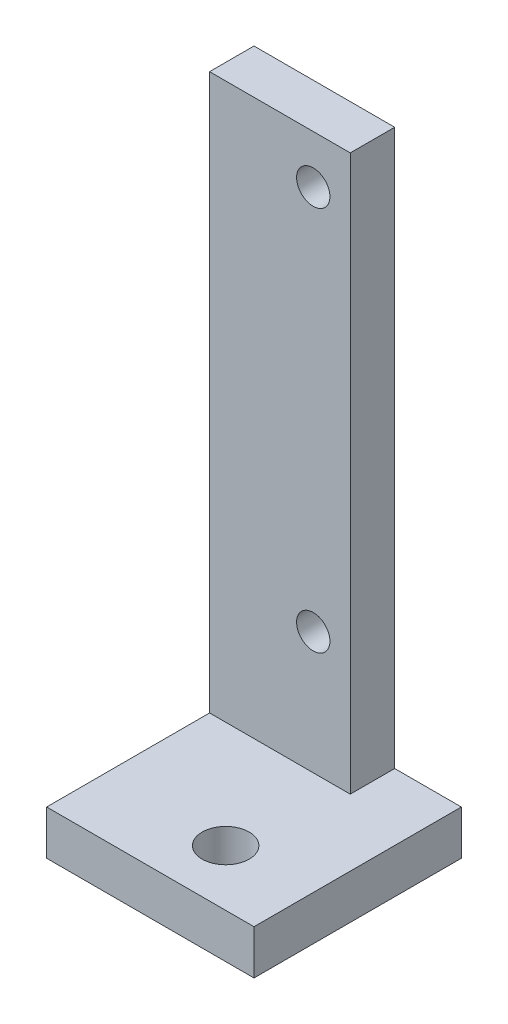
ISO-10303-21;
HEADER;
FILE_DESCRIPTION(('STEP AP214'),'2;1');
FILE_NAME('part.step','',(''),(''),'','','');
FILE_SCHEMA(('AUTOMOTIVE_DESIGN { 1 0 10303 214 1 1 1 1 }'));
ENDSEC;
DATA;
#1=APPLICATION_CONTEXT('core data for automotive mechanical design processes');
#2=APPLICATION_PROTOCOL_DEFINITION('international standard','automotive_design',2000,#1);
#3=PRODUCT_CONTEXT('',#1,'mechanical');
#4=PRODUCT('Part','Part','',(#3));
#5=PRODUCT_RELATED_PRODUCT_CATEGORY('part','',(#4));
#6=PRODUCT_DEFINITION_FORMATION('','',#4);
#7=PRODUCT_DEFINITION_CONTEXT('part definition',#1,'design');
#8=PRODUCT_DEFINITION('design','',#6,#7);
#9=PRODUCT_DEFINITION_SHAPE('','',#8);
#10=(LENGTH_UNIT() NAMED_UNIT(*) SI_UNIT(.MILLI.,.METRE.));
#11=(NAMED_UNIT(*) PLANE_ANGLE_UNIT() SI_UNIT($,.RADIAN.));
#12=(NAMED_UNIT(*) SI_UNIT($,.STERADIAN.) SOLID_ANGLE_UNIT());
#13=UNCERTAINTY_MEASURE_WITH_UNIT(LENGTH_MEASURE(1.E-05),#10,'distance_accuracy_value','');
#14=(GEOMETRIC_REPRESENTATION_CONTEXT(3) GLOBAL_UNCERTAINTY_ASSIGNED_CONTEXT((#13)) GLOBAL_UNIT_ASSIGNED_CONTEXT((#10,
#11,#12)) REPRESENTATION_CONTEXT('',''));
#15=CARTESIAN_POINT('',(0.,0.,0.));
#16=DIRECTION('',(0.,0.,1.));
#17=DIRECTION('',(1.,0.,0.));
#18=AXIS2_PLACEMENT_3D('',#15,#16,#17);
#19=CARTESIAN_POINT('',(4.99999999999999,0.,6.));
#20=DIRECTION('',(1.,0.,0.));
#21=DIRECTION('',(0.,1.,0.));
#22=AXIS2_PLACEMENT_3D('',#19,#20,#21);
#23=PLANE('',#22);
#24=DIRECTION('',(0.,-1.,0.));
#25=VECTOR('',#24,1.);
#26=CARTESIAN_POINT('',(4.99999999999999,0.,0.));
#27=LINE('',#26,#25);
#28=CARTESIAN_POINT('',(4.99999999999999,32.5,0.));
#29=VERTEX_POINT('',#28);
#30=CARTESIAN_POINT('',(5.,-42.5,0.));
#31=VERTEX_POINT('',#30);
#32=EDGE_CURVE('E146',#29,#31,#27,.T.);
#33=ORIENTED_EDGE('',*,*,#32,.F.);
#34=DIRECTION('',(0.,0.,-1.));
#35=VECTOR('',#34,1.);
#36=CARTESIAN_POINT('',(4.99999999999999,32.5,6.));
#37=LINE('',#36,#35);
#38=CARTESIAN_POINT('',(4.99999999999999,32.5,6.));
#39=VERTEX_POINT('',#38);
#40=EDGE_CURVE('E11',#39,#29,#37,.T.);
#41=ORIENTED_EDGE('',*,*,#40,.F.);
#42=DIRECTION('',(0.,-1.,0.));
#43=VECTOR('',#42,1.);
#44=CARTESIAN_POINT('',(4.99999999999999,0.,6.));
#45=LINE('',#44,#43);
#46=CARTESIAN_POINT('',(5.,-42.5,6.));
#47=VERTEX_POINT('',#46);
#48=EDGE_CURVE('E149',#39,#47,#45,.T.);
#49=ORIENTED_EDGE('',*,*,#48,.T.);
#50=DIRECTION('',(0.,0.,-1.));
#51=VECTOR('',#50,1.);
#52=CARTESIAN_POINT('',(5.,-42.5,6.));
#53=LINE('',#52,#51);
#54=EDGE_CURVE('E56',#47,#31,#53,.T.);
#55=ORIENTED_EDGE('',*,*,#54,.T.);
#56=EDGE_LOOP('',(#33,#41,#49,#55));
#57=FACE_BOUND('',#56,.T.);
#58=ADVANCED_FACE('F47',(#57),#23,.T.);
#59=CARTESIAN_POINT('',(0.,32.5,6.));
#60=DIRECTION('',(0.,1.,0.));
#61=DIRECTION('',(0.,0.,1.));
#62=AXIS2_PLACEMENT_3D('',#59,#60,#61);
#63=PLANE('',#62);
#64=DIRECTION('',(1.,0.,0.));
#65=VECTOR('',#64,1.);
#66=CARTESIAN_POINT('',(0.,32.5,0.));
#67=LINE('',#66,#65);
#68=CARTESIAN_POINT('',(-14.,32.5,0.));
#69=VERTEX_POINT('',#68);
#70=EDGE_CURVE('E171',#69,#29,#67,.T.);
#71=ORIENTED_EDGE('',*,*,#70,.F.);
#72=DIRECTION('',(0.,0.,-1.));
#73=VECTOR('',#72,1.);
#74=CARTESIAN_POINT('',(-14.,32.5,0.));
#75=LINE('',#74,#73);
#76=CARTESIAN_POINT('',(-14.,32.5,6.));
#77=VERTEX_POINT('',#76);
#78=EDGE_CURVE('E131',#77,#69,#75,.T.);
#79=ORIENTED_EDGE('',*,*,#78,.F.);
#80=DIRECTION('',(1.,0.,0.));
#81=VECTOR('',#80,1.);
#82=CARTESIAN_POINT('',(0.,32.5,6.));
#83=LINE('',#82,#81);
#84=EDGE_CURVE('E153',#77,#39,#83,.T.);
#85=ORIENTED_EDGE('',*,*,#84,.T.);
#86=ORIENTED_EDGE('',*,*,#40,.T.);
#87=EDGE_LOOP('',(#71,#79,#85,#86));
#88=FACE_BOUND('',#87,.T.);
#89=ADVANCED_FACE('F187',(#88),#63,.T.);
#90=CARTESIAN_POINT('',(0.,26.,6.));
#91=DIRECTION('',(0.,0.,-1.));
#92=DIRECTION('',(-1.,0.,0.));
#93=AXIS2_PLACEMENT_3D('',#90,#91,#92);
#94=CYLINDRICAL_SURFACE('',#93,2.25);
#95=CARTESIAN_POINT('',(0.,26.,6.));
#96=DIRECTION('',(0.,0.,1.));
#97=DIRECTION('',(1.,0.,0.));
#98=AXIS2_PLACEMENT_3D('',#95,#96,#97);
#99=CIRCLE('',#98,2.25);
#100=CARTESIAN_POINT('',(2.25,26.,6.));
#101=VERTEX_POINT('',#100);
#102=EDGE_CURVE('E161',#101,#101,#99,.T.);
#103=ORIENTED_EDGE('',*,*,#102,.T.);
#104=EDGE_LOOP('',(#103));
#105=FACE_BOUND('',#104,.T.);
#106=CARTESIAN_POINT('',(0.,26.,0.));
#107=DIRECTION('',(0.,0.,1.));
#108=DIRECTION('',(1.,0.,0.));
#109=AXIS2_PLACEMENT_3D('',#106,#107,#108);
#110=CIRCLE('',#109,2.25);
#111=CARTESIAN_POINT('',(2.25,26.,0.));
#112=VERTEX_POINT('',#111);
#113=EDGE_CURVE('E175',#112,#112,#110,.T.);
#114=ORIENTED_EDGE('',*,*,#113,.F.);
#115=EDGE_LOOP('',(#114));
#116=FACE_BOUND('',#115,.T.);
#117=ADVANCED_FACE('F241',(#105,#116),#94,.F.);
#118=CARTESIAN_POINT('',(0.,-26.,6.));
#119=DIRECTION('',(0.,0.,-1.));
#120=DIRECTION('',(-1.,0.,0.));
#121=AXIS2_PLACEMENT_3D('',#118,#119,#120);
#122=CYLINDRICAL_SURFACE('',#121,2.25);
#123=CARTESIAN_POINT('',(0.,-26.,6.));
#124=DIRECTION('',(0.,0.,1.));
#125=DIRECTION('',(1.,0.,0.));
#126=AXIS2_PLACEMENT_3D('',#123,#124,#125);
#127=CIRCLE('',#126,2.25);
#128=CARTESIAN_POINT('',(2.25,-26.,6.));
#129=VERTEX_POINT('',#128);
#130=EDGE_CURVE('E165',#129,#129,#127,.F.);
#131=ORIENTED_EDGE('',*,*,#130,.F.);
#132=EDGE_LOOP('',(#131));
#133=FACE_BOUND('',#132,.T.);
#134=CARTESIAN_POINT('',(0.,-26.,0.));
#135=DIRECTION('',(0.,0.,1.));
#136=DIRECTION('',(1.,0.,0.));
#137=AXIS2_PLACEMENT_3D('',#134,#135,#136);
#138=CIRCLE('',#137,2.25);
#139=CARTESIAN_POINT('',(2.25,-26.,0.));
#140=VERTEX_POINT('',#139);
#141=EDGE_CURVE('E154',#140,#140,#138,.F.);
#142=ORIENTED_EDGE('',*,*,#141,.T.);
#143=EDGE_LOOP('',(#142));
#144=FACE_BOUND('',#143,.T.);
#145=ADVANCED_FACE('F246',(#133,#144),#122,.F.);
#146=CARTESIAN_POINT('',(0.,0.,6.));
#147=DIRECTION('',(0.,0.,1.));
#148=DIRECTION('',(1.,0.,0.));
#149=AXIS2_PLACEMENT_3D('',#146,#147,#148);
#150=PLANE('',#149);
#151=ORIENTED_EDGE('',*,*,#48,.F.);
#152=ORIENTED_EDGE('',*,*,#84,.F.);
#153=DIRECTION('',(0.,1.,0.));
#154=VECTOR('',#153,1.);
#155=CARTESIAN_POINT('',(-14.,32.4999999999999,6.));
#156=LINE('',#155,#154);
#157=CARTESIAN_POINT('',(-14.,-42.5,6.));
#158=VERTEX_POINT('',#157);
#159=EDGE_CURVE('E142',#158,#77,#156,.T.);
#160=ORIENTED_EDGE('',*,*,#159,.F.);
#161=DIRECTION('',(1.,0.,0.));
#162=VECTOR('',#161,1.);
#163=CARTESIAN_POINT('',(0.,-42.5,6.));
#164=LINE('',#163,#162);
#165=EDGE_CURVE('E158',#158,#47,#164,.T.);
#166=ORIENTED_EDGE('',*,*,#165,.T.);
#167=EDGE_LOOP('',(#151,#152,#160,#166));
#168=FACE_BOUND('',#167,.T.);
#169=ORIENTED_EDGE('',*,*,#102,.F.);
#170=EDGE_LOOP('',(#169));
#171=FACE_BOUND('',#170,.T.);
#172=ORIENTED_EDGE('',*,*,#130,.T.);
#173=EDGE_LOOP('',(#172));
#174=FACE_BOUND('',#173,.T.);
#175=ADVANCED_FACE('F189',(#168,#171,#174),#150,.T.);
#176=CARTESIAN_POINT('',(0.,0.,0.));
#177=DIRECTION('',(0.,0.,1.));
#178=DIRECTION('',(1.,0.,0.));
#179=AXIS2_PLACEMENT_3D('',#176,#177,#178);
#180=PLANE('',#179);
#181=ORIENTED_EDGE('',*,*,#32,.T.);
#182=DIRECTION('',(1.,0.,0.));
#183=VECTOR('',#182,1.);
#184=CARTESIAN_POINT('',(0.,-42.5,0.));
#185=LINE('',#184,#183);
#186=CARTESIAN_POINT('',(14.,-42.5,0.));
#187=VERTEX_POINT('',#186);
#188=EDGE_CURVE('E128',#31,#187,#185,.T.);
#189=ORIENTED_EDGE('',*,*,#188,.T.);
#190=DIRECTION('',(0.,1.,0.));
#191=VECTOR('',#190,1.);
#192=CARTESIAN_POINT('',(14.,-48.5,0.));
#193=LINE('',#192,#191);
#194=CARTESIAN_POINT('',(14.,-48.5,0.));
#195=VERTEX_POINT('',#194);
#196=EDGE_CURVE('E105',#195,#187,#193,.T.);
#197=ORIENTED_EDGE('',*,*,#196,.F.);
#198=DIRECTION('',(1.,0.,0.));
#199=VECTOR('',#198,1.);
#200=CARTESIAN_POINT('',(0.,-48.5,0.));
#201=LINE('',#200,#199);
#202=CARTESIAN_POINT('',(-14.,-48.5,0.));
#203=VERTEX_POINT('',#202);
#204=EDGE_CURVE('E112',#203,#195,#201,.T.);
#205=ORIENTED_EDGE('',*,*,#204,.F.);
#206=DIRECTION('',(0.,-1.,0.));
#207=VECTOR('',#206,1.);
#208=CARTESIAN_POINT('',(-14.,32.4999999999999,0.));
#209=LINE('',#208,#207);
#210=EDGE_CURVE('E136',#69,#203,#209,.T.);
#211=ORIENTED_EDGE('',*,*,#210,.F.);
#212=ORIENTED_EDGE('',*,*,#70,.T.);
#213=EDGE_LOOP('',(#181,#189,#197,#205,#211,#212));
#214=FACE_BOUND('',#213,.T.);
#215=ORIENTED_EDGE('',*,*,#113,.T.);
#216=EDGE_LOOP('',(#215));
#217=FACE_BOUND('',#216,.T.);
#218=ORIENTED_EDGE('',*,*,#141,.F.);
#219=EDGE_LOOP('',(#218));
#220=FACE_BOUND('',#219,.T.);
#221=ADVANCED_FACE('F126',(#214,#217,#220),#180,.F.);
#222=CARTESIAN_POINT('',(-14.,-48.5,0.));
#223=DIRECTION('',(-1.,0.,0.));
#224=DIRECTION('',(0.,0.,1.));
#225=AXIS2_PLACEMENT_3D('',#222,#223,#224);
#226=PLANE('',#225);
#227=ORIENTED_EDGE('',*,*,#78,.T.);
#228=ORIENTED_EDGE('',*,*,#210,.T.);
#229=DIRECTION('',(0.,0.,1.));
#230=VECTOR('',#229,1.);
#231=CARTESIAN_POINT('',(-14.,-48.5,0.));
#232=LINE('',#231,#230);
#233=CARTESIAN_POINT('',(-14.,-48.5,28.));
#234=VERTEX_POINT('',#233);
#235=EDGE_CURVE('E119',#203,#234,#232,.T.);
#236=ORIENTED_EDGE('',*,*,#235,.T.);
#237=DIRECTION('',(0.,1.,0.));
#238=VECTOR('',#237,1.);
#239=CARTESIAN_POINT('',(-14.,-48.5,28.));
#240=LINE('',#239,#238);
#241=CARTESIAN_POINT('',(-14.,-42.5,28.));
#242=VERTEX_POINT('',#241);
#243=EDGE_CURVE('E138',#234,#242,#240,.T.);
#244=ORIENTED_EDGE('',*,*,#243,.T.);
#245=DIRECTION('',(0.,0.,1.));
#246=VECTOR('',#245,1.);
#247=CARTESIAN_POINT('',(-14.,-42.5,0.));
#248=LINE('',#247,#246);
#249=EDGE_CURVE('E196',#158,#242,#248,.T.);
#250=ORIENTED_EDGE('',*,*,#249,.F.);
#251=ORIENTED_EDGE('',*,*,#159,.T.);
#252=EDGE_LOOP('',(#227,#228,#236,#244,#250,#251));
#253=FACE_BOUND('',#252,.T.);
#254=ADVANCED_FACE('F199',(#253),#226,.T.);
#255=CARTESIAN_POINT('',(14.,-48.5,0.));
#256=DIRECTION('',(-1.,0.,0.));
#257=DIRECTION('',(0.,0.,1.));
#258=AXIS2_PLACEMENT_3D('',#255,#256,#257);
#259=PLANE('',#258);
#260=DIRECTION('',(0.,0.,1.));
#261=VECTOR('',#260,1.);
#262=CARTESIAN_POINT('',(14.,-42.5,0.));
#263=LINE('',#262,#261);
#264=CARTESIAN_POINT('',(14.,-42.5,28.));
#265=VERTEX_POINT('',#264);
#266=EDGE_CURVE('E208',#187,#265,#263,.T.);
#267=ORIENTED_EDGE('',*,*,#266,.T.);
#268=DIRECTION('',(0.,1.,0.));
#269=VECTOR('',#268,1.);
#270=CARTESIAN_POINT('',(14.,-48.5,28.));
#271=LINE('',#270,#269);
#272=CARTESIAN_POINT('',(14.,-48.5,28.));
#273=VERTEX_POINT('',#272);
#274=EDGE_CURVE('E106',#273,#265,#271,.T.);
#275=ORIENTED_EDGE('',*,*,#274,.F.);
#276=DIRECTION('',(0.,0.,1.));
#277=VECTOR('',#276,1.);
#278=CARTESIAN_POINT('',(14.,-48.5,0.));
#279=LINE('',#278,#277);
#280=EDGE_CURVE('E100',#195,#273,#279,.T.);
#281=ORIENTED_EDGE('',*,*,#280,.F.);
#282=ORIENTED_EDGE('',*,*,#196,.T.);
#283=EDGE_LOOP('',(#267,#275,#281,#282));
#284=FACE_BOUND('',#283,.T.);
#285=ADVANCED_FACE('F103',(#284),#259,.F.);
#286=CARTESIAN_POINT('',(0.,-48.5,28.));
#287=DIRECTION('',(0.,0.,1.));
#288=DIRECTION('',(1.,0.,0.));
#289=AXIS2_PLACEMENT_3D('',#286,#287,#288);
#290=PLANE('',#289);
#291=DIRECTION('',(1.,0.,0.));
#292=VECTOR('',#291,1.);
#293=CARTESIAN_POINT('',(0.,-42.5,28.));
#294=LINE('',#293,#292);
#295=EDGE_CURVE('E202',#242,#265,#294,.T.);
#296=ORIENTED_EDGE('',*,*,#295,.F.);
#297=ORIENTED_EDGE('',*,*,#243,.F.);
#298=DIRECTION('',(1.,0.,0.));
#299=VECTOR('',#298,1.);
#300=CARTESIAN_POINT('',(0.,-48.5,28.));
#301=LINE('',#300,#299);
#302=EDGE_CURVE('E111',#234,#273,#301,.T.);
#303=ORIENTED_EDGE('',*,*,#302,.T.);
#304=ORIENTED_EDGE('',*,*,#274,.T.);
#305=EDGE_LOOP('',(#296,#297,#303,#304));
#306=FACE_BOUND('',#305,.T.);
#307=ADVANCED_FACE('F225',(#306),#290,.T.);
#308=CARTESIAN_POINT('',(2.6,-48.5,20.4299482445639));
#309=DIRECTION('',(0.,1.,0.));
#310=DIRECTION('',(0.,0.,1.));
#311=AXIS2_PLACEMENT_3D('',#308,#309,#310);
#312=CYLINDRICAL_SURFACE('',#311,3.175);
#313=CARTESIAN_POINT('',(2.6,-48.5,20.4299482445639));
#314=DIRECTION('',(0.,-1.,0.));
#315=DIRECTION('',(0.,0.,-1.));
#316=AXIS2_PLACEMENT_3D('',#313,#314,#315);
#317=CIRCLE('',#316,3.175);
#318=CARTESIAN_POINT('',(2.6,-48.5,17.2549482445639));
#319=VERTEX_POINT('',#318);
#320=EDGE_CURVE('E212',#319,#319,#317,.T.);
#321=ORIENTED_EDGE('',*,*,#320,.T.);
#322=EDGE_LOOP('',(#321));
#323=FACE_BOUND('',#322,.T.);
#324=CARTESIAN_POINT('',(2.6,-42.5,20.4299482445639));
#325=DIRECTION('',(0.,-1.,0.));
#326=DIRECTION('',(0.,0.,-1.));
#327=AXIS2_PLACEMENT_3D('',#324,#325,#326);
#328=CIRCLE('',#327,3.175);
#329=CARTESIAN_POINT('',(2.6,-42.5,17.2549482445639));
#330=VERTEX_POINT('',#329);
#331=EDGE_CURVE('E123',#330,#330,#328,.T.);
#332=ORIENTED_EDGE('',*,*,#331,.F.);
#333=EDGE_LOOP('',(#332));
#334=FACE_BOUND('',#333,.T.);
#335=ADVANCED_FACE('F228',(#323,#334),#312,.F.);
#336=CARTESIAN_POINT('',(0.,-48.5,0.));
#337=DIRECTION('',(0.,-1.,0.));
#338=DIRECTION('',(0.,0.,-1.));
#339=AXIS2_PLACEMENT_3D('',#336,#337,#338);
#340=PLANE('',#339);
#341=ORIENTED_EDGE('',*,*,#204,.T.);
#342=ORIENTED_EDGE('',*,*,#280,.T.);
#343=ORIENTED_EDGE('',*,*,#302,.F.);
#344=ORIENTED_EDGE('',*,*,#235,.F.);
#345=EDGE_LOOP('',(#341,#342,#343,#344));
#346=FACE_BOUND('',#345,.T.);
#347=ORIENTED_EDGE('',*,*,#320,.F.);
#348=EDGE_LOOP('',(#347));
#349=FACE_BOUND('',#348,.T.);
#350=ADVANCED_FACE('F116',(#346,#349),#340,.T.);
#351=CARTESIAN_POINT('',(0.,-42.5,0.));
#352=DIRECTION('',(0.,-1.,0.));
#353=DIRECTION('',(0.,0.,-1.));
#354=AXIS2_PLACEMENT_3D('',#351,#352,#353);
#355=PLANE('',#354);
#356=ORIENTED_EDGE('',*,*,#54,.F.);
#357=ORIENTED_EDGE('',*,*,#165,.F.);
#358=ORIENTED_EDGE('',*,*,#249,.T.);
#359=ORIENTED_EDGE('',*,*,#295,.T.);
#360=ORIENTED_EDGE('',*,*,#266,.F.);
#361=ORIENTED_EDGE('',*,*,#188,.F.);
#362=EDGE_LOOP('',(#356,#357,#358,#359,#360,#361));
#363=FACE_BOUND('',#362,.T.);
#364=ORIENTED_EDGE('',*,*,#331,.T.);
#365=EDGE_LOOP('',(#364));
#366=FACE_BOUND('',#365,.T.);
#367=ADVANCED_FACE('F193',(#363,#366),#355,.F.);
#368=CLOSED_SHELL('',(#58,#89,#117,#145,#175,#221,#254,#285,#307,#335,#350,#367));
#369=MANIFOLD_SOLID_BREP('B2',#368);
#370=ADVANCED_BREP_SHAPE_REPRESENTATION('',(#18,#369),#14);
#371=SHAPE_DEFINITION_REPRESENTATION(#9,#370);
ENDSEC;
END-ISO-10303-21;
